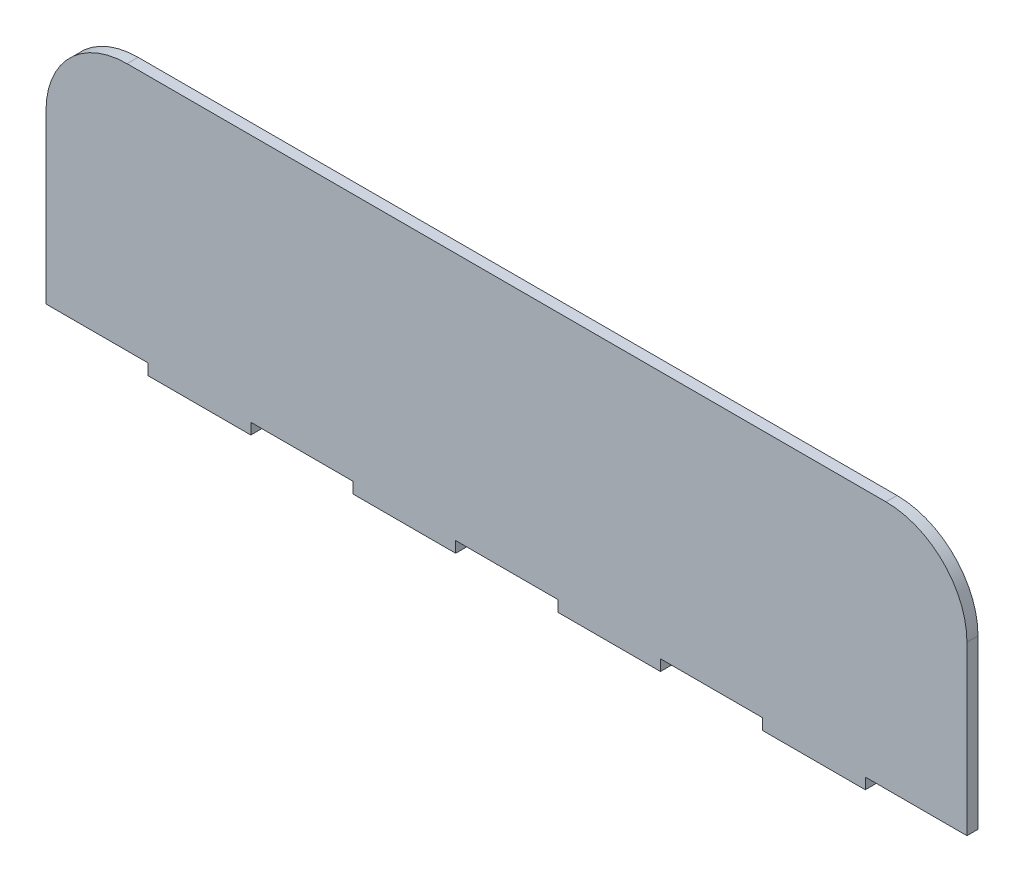
ISO-10303-21;
HEADER;
FILE_DESCRIPTION(('STEP AP214'),'2;1');
FILE_NAME('part.step','',(''),(''),'','','');
FILE_SCHEMA(('AUTOMOTIVE_DESIGN { 1 0 10303 214 1 1 1 1 }'));
ENDSEC;
DATA;
#1=APPLICATION_CONTEXT('core data for automotive mechanical design processes');
#2=APPLICATION_PROTOCOL_DEFINITION('international standard','automotive_design',2000,#1);
#3=PRODUCT_CONTEXT('',#1,'mechanical');
#4=PRODUCT('Part','Part','',(#3));
#5=PRODUCT_RELATED_PRODUCT_CATEGORY('part','',(#4));
#6=PRODUCT_DEFINITION_FORMATION('','',#4);
#7=PRODUCT_DEFINITION_CONTEXT('part definition',#1,'design');
#8=PRODUCT_DEFINITION('design','',#6,#7);
#9=PRODUCT_DEFINITION_SHAPE('','',#8);
#10=(LENGTH_UNIT() NAMED_UNIT(*) SI_UNIT(.MILLI.,.METRE.));
#11=(NAMED_UNIT(*) PLANE_ANGLE_UNIT() SI_UNIT($,.RADIAN.));
#12=(NAMED_UNIT(*) SI_UNIT($,.STERADIAN.) SOLID_ANGLE_UNIT());
#13=UNCERTAINTY_MEASURE_WITH_UNIT(LENGTH_MEASURE(1.E-05),#10,'distance_accuracy_value','');
#14=(GEOMETRIC_REPRESENTATION_CONTEXT(3) GLOBAL_UNCERTAINTY_ASSIGNED_CONTEXT((#13)) GLOBAL_UNIT_ASSIGNED_CONTEXT((#10,
#11,#12)) REPRESENTATION_CONTEXT('',''));
#15=CARTESIAN_POINT('',(0.,0.,0.));
#16=DIRECTION('',(0.,0.,1.));
#17=DIRECTION('',(1.,0.,0.));
#18=AXIS2_PLACEMENT_3D('',#15,#16,#17);
#19=CARTESIAN_POINT('',(0.,0.,6.));
#20=DIRECTION('',(1.,0.,0.));
#21=DIRECTION('',(0.,1.,0.));
#22=AXIS2_PLACEMENT_3D('',#19,#20,#21);
#23=PLANE('',#22);
#24=DIRECTION('',(0.,-1.,0.));
#25=VECTOR('',#24,1.);
#26=CARTESIAN_POINT('',(0.,0.,0.));
#27=LINE('',#26,#25);
#28=CARTESIAN_POINT('',(-1.01271840769201E-13,457.,0.));
#29=VERTEX_POINT('',#28);
#30=CARTESIAN_POINT('',(0.,366.,0.));
#31=VERTEX_POINT('',#30);
#32=EDGE_CURVE('E224',#29,#31,#27,.T.);
#33=ORIENTED_EDGE('',*,*,#32,.T.);
#34=DIRECTION('',(0.,0.,-1.));
#35=VECTOR('',#34,1.);
#36=CARTESIAN_POINT('',(-1.04083408558608E-13,366.,10.));
#37=LINE('',#36,#35);
#38=CARTESIAN_POINT('',(-1.04083408558608E-13,366.,6.));
#39=VERTEX_POINT('',#38);
#40=EDGE_CURVE('E211',#39,#31,#37,.T.);
#41=ORIENTED_EDGE('',*,*,#40,.F.);
#42=DIRECTION('',(0.,-1.,0.));
#43=VECTOR('',#42,1.);
#44=CARTESIAN_POINT('',(0.,0.,6.));
#45=LINE('',#44,#43);
#46=CARTESIAN_POINT('',(-1.01271840769201E-13,457.,6.));
#47=VERTEX_POINT('',#46);
#48=EDGE_CURVE('E225',#47,#39,#45,.T.);
#49=ORIENTED_EDGE('',*,*,#48,.F.);
#50=DIRECTION('',(0.,0.,-1.));
#51=VECTOR('',#50,1.);
#52=CARTESIAN_POINT('',(-1.01271840769201E-13,457.,6.));
#53=LINE('',#52,#51);
#54=EDGE_CURVE('E245',#47,#29,#53,.T.);
#55=ORIENTED_EDGE('',*,*,#54,.T.);
#56=EDGE_LOOP('',(#33,#41,#49,#55));
#57=FACE_BOUND('',#56,.T.);
#58=ADVANCED_FACE('F35',(#57),#23,.F.);
#59=CARTESIAN_POINT('',(500.,0.,6.));
#60=DIRECTION('',(-1.,0.,0.));
#61=DIRECTION('',(0.,-1.,0.));
#62=AXIS2_PLACEMENT_3D('',#59,#60,#61);
#63=PLANE('',#62);
#64=DIRECTION('',(0.,1.,0.));
#65=VECTOR('',#64,1.);
#66=CARTESIAN_POINT('',(500.,0.,6.));
#67=LINE('',#66,#65);
#68=CARTESIAN_POINT('',(500.,366.,6.));
#69=VERTEX_POINT('',#68);
#70=CARTESIAN_POINT('',(500.,457.,6.));
#71=VERTEX_POINT('',#70);
#72=EDGE_CURVE('E228',#69,#71,#67,.T.);
#73=ORIENTED_EDGE('',*,*,#72,.F.);
#74=DIRECTION('',(0.,0.,-1.));
#75=VECTOR('',#74,1.);
#76=CARTESIAN_POINT('',(500.,366.,6.));
#77=LINE('',#76,#75);
#78=CARTESIAN_POINT('',(500.,366.,0.));
#79=VERTEX_POINT('',#78);
#80=EDGE_CURVE('E312',#69,#79,#77,.T.);
#81=ORIENTED_EDGE('',*,*,#80,.T.);
#82=DIRECTION('',(0.,1.,0.));
#83=VECTOR('',#82,1.);
#84=CARTESIAN_POINT('',(500.,0.,0.));
#85=LINE('',#84,#83);
#86=CARTESIAN_POINT('',(500.,457.,0.));
#87=VERTEX_POINT('',#86);
#88=EDGE_CURVE('E237',#79,#87,#85,.T.);
#89=ORIENTED_EDGE('',*,*,#88,.T.);
#90=DIRECTION('',(0.,0.,-1.));
#91=VECTOR('',#90,1.);
#92=CARTESIAN_POINT('',(500.,457.,6.));
#93=LINE('',#92,#91);
#94=EDGE_CURVE('E11',#87,#71,#93,.F.);
#95=ORIENTED_EDGE('',*,*,#94,.T.);
#96=EDGE_LOOP('',(#73,#81,#89,#95));
#97=FACE_BOUND('',#96,.T.);
#98=ADVANCED_FACE('F405',(#97),#63,.F.);
#99=CARTESIAN_POINT('',(-1.11022302462516E-13,501.,6.));
#100=DIRECTION('',(0.,-1.,0.));
#101=DIRECTION('',(0.,0.,-1.));
#102=AXIS2_PLACEMENT_3D('',#99,#100,#101);
#103=PLANE('',#102);
#104=DIRECTION('',(-1.,0.,0.));
#105=VECTOR('',#104,1.);
#106=CARTESIAN_POINT('',(-1.11022302462516E-13,501.,0.));
#107=LINE('',#106,#105);
#108=CARTESIAN_POINT('',(456.,501.,0.));
#109=VERTEX_POINT('',#108);
#110=CARTESIAN_POINT('',(43.9999999999999,501.,0.));
#111=VERTEX_POINT('',#110);
#112=EDGE_CURVE('E229',#109,#111,#107,.T.);
#113=ORIENTED_EDGE('',*,*,#112,.T.);
#114=DIRECTION('',(0.,0.,-1.));
#115=VECTOR('',#114,1.);
#116=CARTESIAN_POINT('',(43.9999999999999,501.,6.));
#117=LINE('',#116,#115);
#118=CARTESIAN_POINT('',(43.9999999999999,501.,6.));
#119=VERTEX_POINT('',#118);
#120=EDGE_CURVE('E43',#111,#119,#117,.F.);
#121=ORIENTED_EDGE('',*,*,#120,.T.);
#122=DIRECTION('',(-1.,0.,0.));
#123=VECTOR('',#122,1.);
#124=CARTESIAN_POINT('',(-1.11022302462516E-13,501.,6.));
#125=LINE('',#124,#123);
#126=CARTESIAN_POINT('',(456.,501.,6.));
#127=VERTEX_POINT('',#126);
#128=EDGE_CURVE('E231',#127,#119,#125,.T.);
#129=ORIENTED_EDGE('',*,*,#128,.F.);
#130=DIRECTION('',(0.,0.,-1.));
#131=VECTOR('',#130,1.);
#132=CARTESIAN_POINT('',(456.,501.,6.));
#133=LINE('',#132,#131);
#134=EDGE_CURVE('E252',#127,#109,#133,.T.);
#135=ORIENTED_EDGE('',*,*,#134,.T.);
#136=EDGE_LOOP('',(#113,#121,#129,#135));
#137=FACE_BOUND('',#136,.T.);
#138=ADVANCED_FACE('F257',(#137),#103,.F.);
#139=CARTESIAN_POINT('',(0.,0.,6.));
#140=DIRECTION('',(0.,0.,-1.));
#141=DIRECTION('',(-1.,0.,0.));
#142=AXIS2_PLACEMENT_3D('',#139,#140,#141);
#143=PLANE('',#142);
#144=DIRECTION('',(0.,-1.,0.));
#145=VECTOR('',#144,1.);
#146=CARTESIAN_POINT('',(55.4999999999999,0.,6.));
#147=LINE('',#146,#145);
#148=CARTESIAN_POINT('',(55.4999999999999,366.,6.));
#149=VERTEX_POINT('',#148);
#150=CARTESIAN_POINT('',(55.4999999999999,360.,6.));
#151=VERTEX_POINT('',#150);
#152=EDGE_CURVE('E222',#149,#151,#147,.T.);
#153=ORIENTED_EDGE('',*,*,#152,.T.);
#154=DIRECTION('',(1.,0.,0.));
#155=VECTOR('',#154,1.);
#156=CARTESIAN_POINT('',(0.,360.,6.));
#157=LINE('',#156,#155);
#158=CARTESIAN_POINT('',(111.2,360.,6.));
#159=VERTEX_POINT('',#158);
#160=EDGE_CURVE('E189',#151,#159,#157,.T.);
#161=ORIENTED_EDGE('',*,*,#160,.T.);
#162=DIRECTION('',(0.,1.,0.));
#163=VECTOR('',#162,1.);
#164=CARTESIAN_POINT('',(111.199999999999,-1.28600833685747E-13,6.));
#165=LINE('',#164,#163);
#166=CARTESIAN_POINT('',(111.2,366.,6.));
#167=VERTEX_POINT('',#166);
#168=EDGE_CURVE('E215',#159,#167,#165,.T.);
#169=ORIENTED_EDGE('',*,*,#168,.T.);
#170=DIRECTION('',(1.,0.,0.));
#171=VECTOR('',#170,1.);
#172=CARTESIAN_POINT('',(0.,366.,6.));
#173=LINE('',#172,#171);
#174=CARTESIAN_POINT('',(166.7,366.,6.));
#175=VERTEX_POINT('',#174);
#176=EDGE_CURVE('E287',#167,#175,#173,.T.);
#177=ORIENTED_EDGE('',*,*,#176,.T.);
#178=DIRECTION('',(0.,-1.,0.));
#179=VECTOR('',#178,1.);
#180=CARTESIAN_POINT('',(166.7,0.,6.));
#181=LINE('',#180,#179);
#182=CARTESIAN_POINT('',(166.7,360.,6.));
#183=VERTEX_POINT('',#182);
#184=EDGE_CURVE('E285',#175,#183,#181,.T.);
#185=ORIENTED_EDGE('',*,*,#184,.T.);
#186=CARTESIAN_POINT('',(222.4,360.,6.));
#187=VERTEX_POINT('',#186);
#188=EDGE_CURVE('E204',#183,#187,#157,.T.);
#189=ORIENTED_EDGE('',*,*,#188,.T.);
#190=DIRECTION('',(0.,1.,0.));
#191=VECTOR('',#190,1.);
#192=CARTESIAN_POINT('',(222.399999999999,-2.57201667371494E-13,6.));
#193=LINE('',#192,#191);
#194=CARTESIAN_POINT('',(222.4,366.,6.));
#195=VERTEX_POINT('',#194);
#196=EDGE_CURVE('E291',#187,#195,#193,.T.);
#197=ORIENTED_EDGE('',*,*,#196,.T.);
#198=DIRECTION('',(1.,0.,0.));
#199=VECTOR('',#198,1.);
#200=CARTESIAN_POINT('',(0.,366.,6.));
#201=LINE('',#200,#199);
#202=CARTESIAN_POINT('',(277.9,366.,6.));
#203=VERTEX_POINT('',#202);
#204=EDGE_CURVE('E297',#195,#203,#201,.T.);
#205=ORIENTED_EDGE('',*,*,#204,.T.);
#206=DIRECTION('',(0.,-1.,0.));
#207=VECTOR('',#206,1.);
#208=CARTESIAN_POINT('',(277.9,0.,6.));
#209=LINE('',#208,#207);
#210=CARTESIAN_POINT('',(277.9,360.,6.));
#211=VERTEX_POINT('',#210);
#212=EDGE_CURVE('E294',#203,#211,#209,.T.);
#213=ORIENTED_EDGE('',*,*,#212,.T.);
#214=CARTESIAN_POINT('',(333.6,360.,6.));
#215=VERTEX_POINT('',#214);
#216=EDGE_CURVE('E372',#211,#215,#157,.T.);
#217=ORIENTED_EDGE('',*,*,#216,.T.);
#218=DIRECTION('',(0.,1.,0.));
#219=VECTOR('',#218,1.);
#220=CARTESIAN_POINT('',(333.6,-3.85802501057241E-13,6.));
#221=LINE('',#220,#219);
#222=CARTESIAN_POINT('',(333.6,366.,6.));
#223=VERTEX_POINT('',#222);
#224=EDGE_CURVE('E300',#215,#223,#221,.T.);
#225=ORIENTED_EDGE('',*,*,#224,.T.);
#226=DIRECTION('',(1.,0.,0.));
#227=VECTOR('',#226,1.);
#228=CARTESIAN_POINT('',(0.,366.,6.));
#229=LINE('',#228,#227);
#230=CARTESIAN_POINT('',(389.1,366.,6.));
#231=VERTEX_POINT('',#230);
#232=EDGE_CURVE('E306',#223,#231,#229,.T.);
#233=ORIENTED_EDGE('',*,*,#232,.T.);
#234=DIRECTION('',(0.,-1.,0.));
#235=VECTOR('',#234,1.);
#236=CARTESIAN_POINT('',(389.1,0.,6.));
#237=LINE('',#236,#235);
#238=CARTESIAN_POINT('',(389.1,360.,6.));
#239=VERTEX_POINT('',#238);
#240=EDGE_CURVE('E303',#231,#239,#237,.T.);
#241=ORIENTED_EDGE('',*,*,#240,.T.);
#242=CARTESIAN_POINT('',(444.8,360.,6.));
#243=VERTEX_POINT('',#242);
#244=EDGE_CURVE('E277',#239,#243,#157,.T.);
#245=ORIENTED_EDGE('',*,*,#244,.T.);
#246=DIRECTION('',(0.,1.,0.));
#247=VECTOR('',#246,1.);
#248=CARTESIAN_POINT('',(444.799999999999,-5.14403334742988E-13,6.));
#249=LINE('',#248,#247);
#250=CARTESIAN_POINT('',(444.8,366.,6.));
#251=VERTEX_POINT('',#250);
#252=EDGE_CURVE('E309',#243,#251,#249,.T.);
#253=ORIENTED_EDGE('',*,*,#252,.T.);
#254=DIRECTION('',(1.,0.,0.));
#255=VECTOR('',#254,1.);
#256=CARTESIAN_POINT('',(0.,366.,6.));
#257=LINE('',#256,#255);
#258=EDGE_CURVE('E315',#251,#69,#257,.T.);
#259=ORIENTED_EDGE('',*,*,#258,.T.);
#260=ORIENTED_EDGE('',*,*,#72,.T.);
#261=CARTESIAN_POINT('',(456.,457.,6.));
#262=DIRECTION('',(0.,0.,-1.));
#263=DIRECTION('',(-1.,0.,0.));
#264=AXIS2_PLACEMENT_3D('',#261,#262,#263);
#265=CIRCLE('',#264,44.);
#266=EDGE_CURVE('E248',#71,#127,#265,.F.);
#267=ORIENTED_EDGE('',*,*,#266,.T.);
#268=ORIENTED_EDGE('',*,*,#128,.T.);
#269=CARTESIAN_POINT('',(43.9999999999999,457.,6.));
#270=DIRECTION('',(0.,0.,-1.));
#271=DIRECTION('',(-1.,0.,0.));
#272=AXIS2_PLACEMENT_3D('',#269,#270,#271);
#273=CIRCLE('',#272,44.);
#274=EDGE_CURVE('E250',#119,#47,#273,.F.);
#275=ORIENTED_EDGE('',*,*,#274,.T.);
#276=ORIENTED_EDGE('',*,*,#48,.T.);
#277=DIRECTION('',(1.,0.,0.));
#278=VECTOR('',#277,1.);
#279=CARTESIAN_POINT('',(0.,366.,6.));
#280=LINE('',#279,#278);
#281=EDGE_CURVE('E193',#39,#149,#280,.T.);
#282=ORIENTED_EDGE('',*,*,#281,.T.);
#283=EDGE_LOOP('',(#153,#161,#169,#177,#185,#189,#197,#205,#213,#217,#225,#233,#241,#245,#253,
#259,#260,#267,#268,#275,#276,#282));
#284=FACE_BOUND('',#283,.T.);
#285=ADVANCED_FACE('F263',(#284),#143,.F.);
#286=CARTESIAN_POINT('',(0.,0.,0.));
#287=DIRECTION('',(0.,0.,-1.));
#288=DIRECTION('',(-1.,0.,0.));
#289=AXIS2_PLACEMENT_3D('',#286,#287,#288);
#290=PLANE('',#289);
#291=DIRECTION('',(1.,0.,0.));
#292=VECTOR('',#291,1.);
#293=CARTESIAN_POINT('',(500.,360.,0.));
#294=LINE('',#293,#292);
#295=CARTESIAN_POINT('',(55.4999999999999,360.,0.));
#296=VERTEX_POINT('',#295);
#297=CARTESIAN_POINT('',(111.2,360.,0.));
#298=VERTEX_POINT('',#297);
#299=EDGE_CURVE('E186',#296,#298,#294,.T.);
#300=ORIENTED_EDGE('',*,*,#299,.F.);
#301=DIRECTION('',(0.,-1.,0.));
#302=VECTOR('',#301,1.);
#303=CARTESIAN_POINT('',(55.4999999999999,360.,0.));
#304=LINE('',#303,#302);
#305=CARTESIAN_POINT('',(55.4999999999999,366.,0.));
#306=VERTEX_POINT('',#305);
#307=EDGE_CURVE('E201',#306,#296,#304,.T.);
#308=ORIENTED_EDGE('',*,*,#307,.F.);
#309=DIRECTION('',(1.,0.,0.));
#310=VECTOR('',#309,1.);
#311=CARTESIAN_POINT('',(-1.04083408558608E-13,366.,0.));
#312=LINE('',#311,#310);
#313=EDGE_CURVE('E212',#31,#306,#312,.T.);
#314=ORIENTED_EDGE('',*,*,#313,.F.);
#315=ORIENTED_EDGE('',*,*,#32,.F.);
#316=CARTESIAN_POINT('',(43.9999999999999,457.,0.));
#317=DIRECTION('',(0.,0.,-1.));
#318=DIRECTION('',(-1.,0.,0.));
#319=AXIS2_PLACEMENT_3D('',#316,#317,#318);
#320=CIRCLE('',#319,44.);
#321=EDGE_CURVE('E243',#29,#111,#320,.T.);
#322=ORIENTED_EDGE('',*,*,#321,.T.);
#323=ORIENTED_EDGE('',*,*,#112,.F.);
#324=CARTESIAN_POINT('',(456.,457.,0.));
#325=DIRECTION('',(0.,0.,-1.));
#326=DIRECTION('',(-1.,0.,0.));
#327=AXIS2_PLACEMENT_3D('',#324,#325,#326);
#328=CIRCLE('',#327,44.);
#329=EDGE_CURVE('E234',#109,#87,#328,.T.);
#330=ORIENTED_EDGE('',*,*,#329,.T.);
#331=ORIENTED_EDGE('',*,*,#88,.F.);
#332=DIRECTION('',(1.,0.,0.));
#333=VECTOR('',#332,1.);
#334=CARTESIAN_POINT('',(444.8,366.,0.));
#335=LINE('',#334,#333);
#336=CARTESIAN_POINT('',(444.8,366.,0.));
#337=VERTEX_POINT('',#336);
#338=EDGE_CURVE('E322',#337,#79,#335,.T.);
#339=ORIENTED_EDGE('',*,*,#338,.F.);
#340=DIRECTION('',(0.,1.,0.));
#341=VECTOR('',#340,1.);
#342=CARTESIAN_POINT('',(444.8,360.,0.));
#343=LINE('',#342,#341);
#344=CARTESIAN_POINT('',(444.8,360.,0.));
#345=VERTEX_POINT('',#344);
#346=EDGE_CURVE('E276',#345,#337,#343,.T.);
#347=ORIENTED_EDGE('',*,*,#346,.F.);
#348=CARTESIAN_POINT('',(389.1,360.,0.));
#349=VERTEX_POINT('',#348);
#350=EDGE_CURVE('E207',#349,#345,#294,.T.);
#351=ORIENTED_EDGE('',*,*,#350,.F.);
#352=DIRECTION('',(0.,-1.,0.));
#353=VECTOR('',#352,1.);
#354=CARTESIAN_POINT('',(389.1,360.,0.));
#355=LINE('',#354,#353);
#356=CARTESIAN_POINT('',(389.1,366.,0.));
#357=VERTEX_POINT('',#356);
#358=EDGE_CURVE('E332',#357,#349,#355,.T.);
#359=ORIENTED_EDGE('',*,*,#358,.F.);
#360=DIRECTION('',(1.,0.,0.));
#361=VECTOR('',#360,1.);
#362=CARTESIAN_POINT('',(333.6,366.,0.));
#363=LINE('',#362,#361);
#364=CARTESIAN_POINT('',(333.6,366.,0.));
#365=VERTEX_POINT('',#364);
#366=EDGE_CURVE('E342',#365,#357,#363,.T.);
#367=ORIENTED_EDGE('',*,*,#366,.F.);
#368=DIRECTION('',(0.,1.,0.));
#369=VECTOR('',#368,1.);
#370=CARTESIAN_POINT('',(333.6,360.,0.));
#371=LINE('',#370,#369);
#372=CARTESIAN_POINT('',(333.6,360.,0.));
#373=VERTEX_POINT('',#372);
#374=EDGE_CURVE('E325',#373,#365,#371,.T.);
#375=ORIENTED_EDGE('',*,*,#374,.F.);
#376=CARTESIAN_POINT('',(277.9,360.,0.));
#377=VERTEX_POINT('',#376);
#378=EDGE_CURVE('E373',#377,#373,#294,.T.);
#379=ORIENTED_EDGE('',*,*,#378,.F.);
#380=DIRECTION('',(0.,-1.,0.));
#381=VECTOR('',#380,1.);
#382=CARTESIAN_POINT('',(277.9,360.,0.));
#383=LINE('',#382,#381);
#384=CARTESIAN_POINT('',(277.9,366.,0.));
#385=VERTEX_POINT('',#384);
#386=EDGE_CURVE('E349',#385,#377,#383,.T.);
#387=ORIENTED_EDGE('',*,*,#386,.F.);
#388=DIRECTION('',(1.,0.,0.));
#389=VECTOR('',#388,1.);
#390=CARTESIAN_POINT('',(222.4,366.,0.));
#391=LINE('',#390,#389);
#392=CARTESIAN_POINT('',(222.4,366.,0.));
#393=VERTEX_POINT('',#392);
#394=EDGE_CURVE('E358',#393,#385,#391,.T.);
#395=ORIENTED_EDGE('',*,*,#394,.F.);
#396=DIRECTION('',(0.,1.,0.));
#397=VECTOR('',#396,1.);
#398=CARTESIAN_POINT('',(222.4,360.,0.));
#399=LINE('',#398,#397);
#400=CARTESIAN_POINT('',(222.4,360.,0.));
#401=VERTEX_POINT('',#400);
#402=EDGE_CURVE('E339',#401,#393,#399,.T.);
#403=ORIENTED_EDGE('',*,*,#402,.F.);
#404=CARTESIAN_POINT('',(166.7,360.,0.));
#405=VERTEX_POINT('',#404);
#406=EDGE_CURVE('E205',#405,#401,#294,.T.);
#407=ORIENTED_EDGE('',*,*,#406,.F.);
#408=DIRECTION('',(0.,-1.,0.));
#409=VECTOR('',#408,1.);
#410=CARTESIAN_POINT('',(166.7,360.,0.));
#411=LINE('',#410,#409);
#412=CARTESIAN_POINT('',(166.7,366.,0.));
#413=VERTEX_POINT('',#412);
#414=EDGE_CURVE('E362',#413,#405,#411,.T.);
#415=ORIENTED_EDGE('',*,*,#414,.F.);
#416=DIRECTION('',(1.,0.,0.));
#417=VECTOR('',#416,1.);
#418=CARTESIAN_POINT('',(111.2,366.,0.));
#419=LINE('',#418,#417);
#420=CARTESIAN_POINT('',(111.2,366.,0.));
#421=VERTEX_POINT('',#420);
#422=EDGE_CURVE('E369',#421,#413,#419,.T.);
#423=ORIENTED_EDGE('',*,*,#422,.F.);
#424=DIRECTION('',(0.,1.,0.));
#425=VECTOR('',#424,1.);
#426=CARTESIAN_POINT('',(111.2,360.,0.));
#427=LINE('',#426,#425);
#428=EDGE_CURVE('E203',#298,#421,#427,.T.);
#429=ORIENTED_EDGE('',*,*,#428,.F.);
#430=EDGE_LOOP('',(#300,#308,#314,#315,#322,#323,#330,#331,#339,#347,#351,#359,#367,#375,#379,
#387,#395,#403,#407,#415,#423,#429));
#431=FACE_BOUND('',#430,.T.);
#432=ADVANCED_FACE('F199',(#431),#290,.T.);
#433=CARTESIAN_POINT('',(43.9999999999999,457.,6.));
#434=DIRECTION('',(0.,0.,-1.));
#435=DIRECTION('',(-1.,0.,0.));
#436=AXIS2_PLACEMENT_3D('',#433,#434,#435);
#437=CYLINDRICAL_SURFACE('',#436,44.);
#438=ORIENTED_EDGE('',*,*,#274,.F.);
#439=ORIENTED_EDGE('',*,*,#120,.F.);
#440=ORIENTED_EDGE('',*,*,#321,.F.);
#441=ORIENTED_EDGE('',*,*,#54,.F.);
#442=EDGE_LOOP('',(#438,#439,#440,#441));
#443=FACE_BOUND('',#442,.T.);
#444=ADVANCED_FACE('F267',(#443),#437,.T.);
#445=CARTESIAN_POINT('',(456.,457.,6.));
#446=DIRECTION('',(0.,0.,-1.));
#447=DIRECTION('',(-1.,0.,0.));
#448=AXIS2_PLACEMENT_3D('',#445,#446,#447);
#449=CYLINDRICAL_SURFACE('',#448,44.);
#450=ORIENTED_EDGE('',*,*,#266,.F.);
#451=ORIENTED_EDGE('',*,*,#94,.F.);
#452=ORIENTED_EDGE('',*,*,#329,.F.);
#453=ORIENTED_EDGE('',*,*,#134,.F.);
#454=EDGE_LOOP('',(#450,#451,#452,#453));
#455=FACE_BOUND('',#454,.T.);
#456=ADVANCED_FACE('F37',(#455),#449,.T.);
#457=CARTESIAN_POINT('',(55.4999999999999,360.,10.));
#458=DIRECTION('',(1.,0.,0.));
#459=DIRECTION('',(0.,0.,-1.));
#460=AXIS2_PLACEMENT_3D('',#457,#458,#459);
#461=PLANE('',#460);
#462=DIRECTION('',(0.,0.,-1.));
#463=VECTOR('',#462,1.);
#464=CARTESIAN_POINT('',(55.4999999999999,366.,10.));
#465=LINE('',#464,#463);
#466=EDGE_CURVE('E194',#149,#306,#465,.T.);
#467=ORIENTED_EDGE('',*,*,#466,.T.);
#468=ORIENTED_EDGE('',*,*,#307,.T.);
#469=DIRECTION('',(0.,0.,-1.));
#470=VECTOR('',#469,1.);
#471=CARTESIAN_POINT('',(55.4999999999999,360.,10.));
#472=LINE('',#471,#470);
#473=EDGE_CURVE('E183',#151,#296,#472,.T.);
#474=ORIENTED_EDGE('',*,*,#473,.F.);
#475=ORIENTED_EDGE('',*,*,#152,.F.);
#476=EDGE_LOOP('',(#467,#468,#474,#475));
#477=FACE_BOUND('',#476,.T.);
#478=ADVANCED_FACE('F208',(#477),#461,.F.);
#479=CARTESIAN_POINT('',(-1.04083408558608E-13,366.,10.));
#480=DIRECTION('',(0.,1.,0.));
#481=DIRECTION('',(0.,0.,1.));
#482=AXIS2_PLACEMENT_3D('',#479,#480,#481);
#483=PLANE('',#482);
#484=ORIENTED_EDGE('',*,*,#40,.T.);
#485=ORIENTED_EDGE('',*,*,#313,.T.);
#486=ORIENTED_EDGE('',*,*,#466,.F.);
#487=ORIENTED_EDGE('',*,*,#281,.F.);
#488=EDGE_LOOP('',(#484,#485,#486,#487));
#489=FACE_BOUND('',#488,.T.);
#490=ADVANCED_FACE('F272',(#489),#483,.F.);
#491=CARTESIAN_POINT('',(444.8,360.,10.));
#492=DIRECTION('',(-1.,0.,0.));
#493=DIRECTION('',(0.,-1.,0.));
#494=AXIS2_PLACEMENT_3D('',#491,#492,#493);
#495=PLANE('',#494);
#496=DIRECTION('',(0.,0.,-1.));
#497=VECTOR('',#496,1.);
#498=CARTESIAN_POINT('',(444.8,360.,10.));
#499=LINE('',#498,#497);
#500=EDGE_CURVE('E321',#243,#345,#499,.T.);
#501=ORIENTED_EDGE('',*,*,#500,.T.);
#502=ORIENTED_EDGE('',*,*,#346,.T.);
#503=DIRECTION('',(0.,0.,-1.));
#504=VECTOR('',#503,1.);
#505=CARTESIAN_POINT('',(444.8,366.,10.));
#506=LINE('',#505,#504);
#507=EDGE_CURVE('E318',#251,#337,#506,.T.);
#508=ORIENTED_EDGE('',*,*,#507,.F.);
#509=ORIENTED_EDGE('',*,*,#252,.F.);
#510=EDGE_LOOP('',(#501,#502,#508,#509));
#511=FACE_BOUND('',#510,.T.);
#512=ADVANCED_FACE('F458',(#511),#495,.F.);
#513=CARTESIAN_POINT('',(444.8,366.,10.));
#514=DIRECTION('',(0.,1.,0.));
#515=DIRECTION('',(0.,0.,1.));
#516=AXIS2_PLACEMENT_3D('',#513,#514,#515);
#517=PLANE('',#516);
#518=ORIENTED_EDGE('',*,*,#258,.F.);
#519=ORIENTED_EDGE('',*,*,#507,.T.);
#520=ORIENTED_EDGE('',*,*,#338,.T.);
#521=ORIENTED_EDGE('',*,*,#80,.F.);
#522=EDGE_LOOP('',(#518,#519,#520,#521));
#523=FACE_BOUND('',#522,.T.);
#524=ADVANCED_FACE('F463',(#523),#517,.F.);
#525=CARTESIAN_POINT('',(333.6,360.,10.));
#526=DIRECTION('',(-1.,0.,0.));
#527=DIRECTION('',(0.,-1.,0.));
#528=AXIS2_PLACEMENT_3D('',#525,#526,#527);
#529=PLANE('',#528);
#530=DIRECTION('',(0.,0.,-1.));
#531=VECTOR('',#530,1.);
#532=CARTESIAN_POINT('',(333.6,360.,10.));
#533=LINE('',#532,#531);
#534=EDGE_CURVE('E336',#215,#373,#533,.T.);
#535=ORIENTED_EDGE('',*,*,#534,.T.);
#536=ORIENTED_EDGE('',*,*,#374,.T.);
#537=DIRECTION('',(0.,0.,-1.));
#538=VECTOR('',#537,1.);
#539=CARTESIAN_POINT('',(333.6,366.,10.));
#540=LINE('',#539,#538);
#541=EDGE_CURVE('E328',#223,#365,#540,.T.);
#542=ORIENTED_EDGE('',*,*,#541,.F.);
#543=ORIENTED_EDGE('',*,*,#224,.F.);
#544=EDGE_LOOP('',(#535,#536,#542,#543));
#545=FACE_BOUND('',#544,.T.);
#546=ADVANCED_FACE('F471',(#545),#529,.F.);
#547=CARTESIAN_POINT('',(389.1,360.,10.));
#548=DIRECTION('',(1.,0.,0.));
#549=DIRECTION('',(0.,0.,-1.));
#550=AXIS2_PLACEMENT_3D('',#547,#548,#549);
#551=PLANE('',#550);
#552=DIRECTION('',(0.,0.,-1.));
#553=VECTOR('',#552,1.);
#554=CARTESIAN_POINT('',(389.1,366.,10.));
#555=LINE('',#554,#553);
#556=EDGE_CURVE('E331',#231,#357,#555,.T.);
#557=ORIENTED_EDGE('',*,*,#556,.T.);
#558=ORIENTED_EDGE('',*,*,#358,.T.);
#559=DIRECTION('',(0.,0.,-1.));
#560=VECTOR('',#559,1.);
#561=CARTESIAN_POINT('',(389.1,360.,10.));
#562=LINE('',#561,#560);
#563=EDGE_CURVE('E334',#239,#349,#562,.T.);
#564=ORIENTED_EDGE('',*,*,#563,.F.);
#565=ORIENTED_EDGE('',*,*,#240,.F.);
#566=EDGE_LOOP('',(#557,#558,#564,#565));
#567=FACE_BOUND('',#566,.T.);
#568=ADVANCED_FACE('F476',(#567),#551,.F.);
#569=CARTESIAN_POINT('',(333.6,366.,10.));
#570=DIRECTION('',(0.,1.,0.));
#571=DIRECTION('',(0.,0.,1.));
#572=AXIS2_PLACEMENT_3D('',#569,#570,#571);
#573=PLANE('',#572);
#574=ORIENTED_EDGE('',*,*,#541,.T.);
#575=ORIENTED_EDGE('',*,*,#366,.T.);
#576=ORIENTED_EDGE('',*,*,#556,.F.);
#577=ORIENTED_EDGE('',*,*,#232,.F.);
#578=EDGE_LOOP('',(#574,#575,#576,#577));
#579=FACE_BOUND('',#578,.T.);
#580=ADVANCED_FACE('F486',(#579),#573,.F.);
#581=CARTESIAN_POINT('',(222.4,360.,10.));
#582=DIRECTION('',(-1.,0.,0.));
#583=DIRECTION('',(0.,-1.,0.));
#584=AXIS2_PLACEMENT_3D('',#581,#582,#583);
#585=PLANE('',#584);
#586=DIRECTION('',(0.,0.,-1.));
#587=VECTOR('',#586,1.);
#588=CARTESIAN_POINT('',(222.4,360.,10.));
#589=LINE('',#588,#587);
#590=EDGE_CURVE('E353',#187,#401,#589,.T.);
#591=ORIENTED_EDGE('',*,*,#590,.T.);
#592=ORIENTED_EDGE('',*,*,#402,.T.);
#593=DIRECTION('',(0.,0.,-1.));
#594=VECTOR('',#593,1.);
#595=CARTESIAN_POINT('',(222.4,366.,10.));
#596=LINE('',#595,#594);
#597=EDGE_CURVE('E346',#195,#393,#596,.T.);
#598=ORIENTED_EDGE('',*,*,#597,.F.);
#599=ORIENTED_EDGE('',*,*,#196,.F.);
#600=EDGE_LOOP('',(#591,#592,#598,#599));
#601=FACE_BOUND('',#600,.T.);
#602=ADVANCED_FACE('F386',(#601),#585,.F.);
#603=CARTESIAN_POINT('',(277.9,360.,10.));
#604=DIRECTION('',(1.,0.,0.));
#605=DIRECTION('',(0.,0.,-1.));
#606=AXIS2_PLACEMENT_3D('',#603,#604,#605);
#607=PLANE('',#606);
#608=DIRECTION('',(0.,0.,-1.));
#609=VECTOR('',#608,1.);
#610=CARTESIAN_POINT('',(277.9,366.,10.));
#611=LINE('',#610,#609);
#612=EDGE_CURVE('E58',#203,#385,#611,.T.);
#613=ORIENTED_EDGE('',*,*,#612,.T.);
#614=ORIENTED_EDGE('',*,*,#386,.T.);
#615=DIRECTION('',(0.,0.,-1.));
#616=VECTOR('',#615,1.);
#617=CARTESIAN_POINT('',(277.9,360.,10.));
#618=LINE('',#617,#616);
#619=EDGE_CURVE('E351',#211,#377,#618,.T.);
#620=ORIENTED_EDGE('',*,*,#619,.F.);
#621=ORIENTED_EDGE('',*,*,#212,.F.);
#622=EDGE_LOOP('',(#613,#614,#620,#621));
#623=FACE_BOUND('',#622,.T.);
#624=ADVANCED_FACE('F498',(#623),#607,.F.);
#625=CARTESIAN_POINT('',(222.4,366.,10.));
#626=DIRECTION('',(0.,1.,0.));
#627=DIRECTION('',(0.,0.,1.));
#628=AXIS2_PLACEMENT_3D('',#625,#626,#627);
#629=PLANE('',#628);
#630=ORIENTED_EDGE('',*,*,#597,.T.);
#631=ORIENTED_EDGE('',*,*,#394,.T.);
#632=ORIENTED_EDGE('',*,*,#612,.F.);
#633=ORIENTED_EDGE('',*,*,#204,.F.);
#634=EDGE_LOOP('',(#630,#631,#632,#633));
#635=FACE_BOUND('',#634,.T.);
#636=ADVANCED_FACE('F390',(#635),#629,.F.);
#637=CARTESIAN_POINT('',(111.2,360.,10.));
#638=DIRECTION('',(-1.,0.,0.));
#639=DIRECTION('',(0.,-1.,0.));
#640=AXIS2_PLACEMENT_3D('',#637,#638,#639);
#641=PLANE('',#640);
#642=DIRECTION('',(0.,0.,-1.));
#643=VECTOR('',#642,1.);
#644=CARTESIAN_POINT('',(111.2,360.,10.));
#645=LINE('',#644,#643);
#646=EDGE_CURVE('E282',#159,#298,#645,.T.);
#647=ORIENTED_EDGE('',*,*,#646,.T.);
#648=ORIENTED_EDGE('',*,*,#428,.T.);
#649=DIRECTION('',(0.,0.,-1.));
#650=VECTOR('',#649,1.);
#651=CARTESIAN_POINT('',(111.2,366.,10.));
#652=LINE('',#651,#650);
#653=EDGE_CURVE('E284',#167,#421,#652,.T.);
#654=ORIENTED_EDGE('',*,*,#653,.F.);
#655=ORIENTED_EDGE('',*,*,#168,.F.);
#656=EDGE_LOOP('',(#647,#648,#654,#655));
#657=FACE_BOUND('',#656,.T.);
#658=ADVANCED_FACE('F281',(#657),#641,.F.);
#659=CARTESIAN_POINT('',(166.7,360.,10.));
#660=DIRECTION('',(1.,0.,0.));
#661=DIRECTION('',(0.,0.,-1.));
#662=AXIS2_PLACEMENT_3D('',#659,#660,#661);
#663=PLANE('',#662);
#664=DIRECTION('',(0.,0.,-1.));
#665=VECTOR('',#664,1.);
#666=CARTESIAN_POINT('',(166.7,366.,10.));
#667=LINE('',#666,#665);
#668=EDGE_CURVE('E50',#175,#413,#667,.T.);
#669=ORIENTED_EDGE('',*,*,#668,.T.);
#670=ORIENTED_EDGE('',*,*,#414,.T.);
#671=DIRECTION('',(0.,0.,-1.));
#672=VECTOR('',#671,1.);
#673=CARTESIAN_POINT('',(166.7,360.,10.));
#674=LINE('',#673,#672);
#675=EDGE_CURVE('E364',#183,#405,#674,.T.);
#676=ORIENTED_EDGE('',*,*,#675,.F.);
#677=ORIENTED_EDGE('',*,*,#184,.F.);
#678=EDGE_LOOP('',(#669,#670,#676,#677));
#679=FACE_BOUND('',#678,.T.);
#680=ADVANCED_FACE('F392',(#679),#663,.F.);
#681=CARTESIAN_POINT('',(111.2,366.,10.));
#682=DIRECTION('',(0.,1.,0.));
#683=DIRECTION('',(0.,0.,1.));
#684=AXIS2_PLACEMENT_3D('',#681,#682,#683);
#685=PLANE('',#684);
#686=ORIENTED_EDGE('',*,*,#653,.T.);
#687=ORIENTED_EDGE('',*,*,#422,.T.);
#688=ORIENTED_EDGE('',*,*,#668,.F.);
#689=ORIENTED_EDGE('',*,*,#176,.F.);
#690=EDGE_LOOP('',(#686,#687,#688,#689));
#691=FACE_BOUND('',#690,.T.);
#692=ADVANCED_FACE('F393',(#691),#685,.F.);
#693=CARTESIAN_POINT('',(500.,360.,10.));
#694=DIRECTION('',(0.,1.,0.));
#695=DIRECTION('',(0.,0.,1.));
#696=AXIS2_PLACEMENT_3D('',#693,#694,#695);
#697=PLANE('',#696);
#698=ORIENTED_EDGE('',*,*,#188,.F.);
#699=ORIENTED_EDGE('',*,*,#675,.T.);
#700=ORIENTED_EDGE('',*,*,#406,.T.);
#701=ORIENTED_EDGE('',*,*,#590,.F.);
#702=EDGE_LOOP('',(#698,#699,#700,#701));
#703=FACE_BOUND('',#702,.T.);
#704=ADVANCED_FACE('F380',(#703),#697,.F.);
#705=ORIENTED_EDGE('',*,*,#473,.T.);
#706=ORIENTED_EDGE('',*,*,#299,.T.);
#707=ORIENTED_EDGE('',*,*,#646,.F.);
#708=ORIENTED_EDGE('',*,*,#160,.F.);
#709=EDGE_LOOP('',(#705,#706,#707,#708));
#710=FACE_BOUND('',#709,.T.);
#711=ADVANCED_FACE('F185',(#710),#697,.F.);
#712=ORIENTED_EDGE('',*,*,#216,.F.);
#713=ORIENTED_EDGE('',*,*,#619,.T.);
#714=ORIENTED_EDGE('',*,*,#378,.T.);
#715=ORIENTED_EDGE('',*,*,#534,.F.);
#716=EDGE_LOOP('',(#712,#713,#714,#715));
#717=FACE_BOUND('',#716,.T.);
#718=ADVANCED_FACE('F401',(#717),#697,.F.);
#719=ORIENTED_EDGE('',*,*,#244,.F.);
#720=ORIENTED_EDGE('',*,*,#563,.T.);
#721=ORIENTED_EDGE('',*,*,#350,.T.);
#722=ORIENTED_EDGE('',*,*,#500,.F.);
#723=EDGE_LOOP('',(#719,#720,#721,#722));
#724=FACE_BOUND('',#723,.T.);
#725=ADVANCED_FACE('F537',(#724),#697,.F.);
#726=CLOSED_SHELL('',(#58,#98,#138,#285,#432,#444,#456,#478,#490,#512,#524,#546,#568,#580,#602,
#624,#636,#658,#680,#692,#704,#711,#718,#725));
#727=MANIFOLD_SOLID_BREP('B2',#726);
#728=ADVANCED_BREP_SHAPE_REPRESENTATION('',(#18,#727),#14);
#729=SHAPE_DEFINITION_REPRESENTATION(#9,#728);
ENDSEC;
END-ISO-10303-21;
